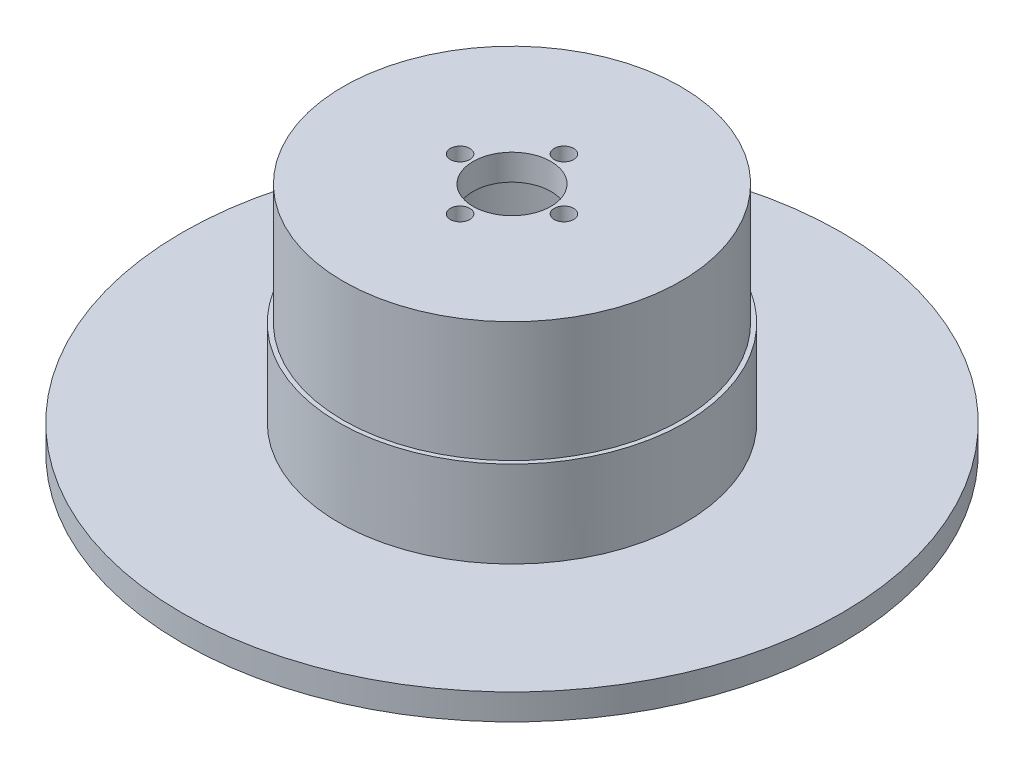
ISO-10303-21;
HEADER;
FILE_DESCRIPTION(('STEP AP214'),'2;1');
FILE_NAME('part.step','',(''),(''),'','','');
FILE_SCHEMA(('AUTOMOTIVE_DESIGN { 1 0 10303 214 1 1 1 1 }'));
ENDSEC;
DATA;
#1=APPLICATION_CONTEXT('core data for automotive mechanical design processes');
#2=APPLICATION_PROTOCOL_DEFINITION('international standard','automotive_design',2000,#1);
#3=PRODUCT_CONTEXT('',#1,'mechanical');
#4=PRODUCT('Part','Part','',(#3));
#5=PRODUCT_RELATED_PRODUCT_CATEGORY('part','',(#4));
#6=PRODUCT_DEFINITION_FORMATION('','',#4);
#7=PRODUCT_DEFINITION_CONTEXT('part definition',#1,'design');
#8=PRODUCT_DEFINITION('design','',#6,#7);
#9=PRODUCT_DEFINITION_SHAPE('','',#8);
#10=(LENGTH_UNIT() NAMED_UNIT(*) SI_UNIT(.MILLI.,.METRE.));
#11=(NAMED_UNIT(*) PLANE_ANGLE_UNIT() SI_UNIT($,.RADIAN.));
#12=(NAMED_UNIT(*) SI_UNIT($,.STERADIAN.) SOLID_ANGLE_UNIT());
#13=UNCERTAINTY_MEASURE_WITH_UNIT(LENGTH_MEASURE(1.E-05),#10,'distance_accuracy_value','');
#14=(GEOMETRIC_REPRESENTATION_CONTEXT(3) GLOBAL_UNCERTAINTY_ASSIGNED_CONTEXT((#13)) GLOBAL_UNIT_ASSIGNED_CONTEXT((#10,
#11,#12)) REPRESENTATION_CONTEXT('',''));
#15=CARTESIAN_POINT('',(0.,0.,0.));
#16=DIRECTION('',(0.,0.,1.));
#17=DIRECTION('',(1.,0.,0.));
#18=AXIS2_PLACEMENT_3D('',#15,#16,#17);
#19=CARTESIAN_POINT('',(0.,3.,0.));
#20=DIRECTION('',(0.,-1.,0.));
#21=DIRECTION('',(0.,0.,-1.));
#22=AXIS2_PLACEMENT_3D('',#19,#20,#21);
#23=PLANE('',#22);
#24=CARTESIAN_POINT('',(0.,3.,0.));
#25=DIRECTION('',(0.,-1.,0.));
#26=DIRECTION('',(0.,0.,-1.));
#27=AXIS2_PLACEMENT_3D('',#24,#25,#26);
#28=CIRCLE('',#27,38.1);
#29=CARTESIAN_POINT('',(0.,3.,-38.1));
#30=VERTEX_POINT('',#29);
#31=EDGE_CURVE('E42',#30,#30,#28,.T.);
#32=ORIENTED_EDGE('',*,*,#31,.F.);
#33=EDGE_LOOP('',(#32));
#34=FACE_BOUND('',#33,.T.);
#35=CARTESIAN_POINT('',(0.,3.,0.));
#36=DIRECTION('',(0.,-1.,0.));
#37=DIRECTION('',(0.,0.,-1.));
#38=AXIS2_PLACEMENT_3D('',#35,#36,#37);
#39=CIRCLE('',#38,20.);
#40=CARTESIAN_POINT('',(0.,3.,-20.));
#41=VERTEX_POINT('',#40);
#42=EDGE_CURVE('E10',#41,#41,#39,.F.);
#43=ORIENTED_EDGE('',*,*,#42,.F.);
#44=EDGE_LOOP('',(#43));
#45=FACE_BOUND('',#44,.T.);
#46=ADVANCED_FACE('F31',(#34,#45),#23,.F.);
#47=CARTESIAN_POINT('',(0.,23.9,0.));
#48=DIRECTION('',(0.,-1.,0.));
#49=DIRECTION('',(0.,0.,-1.));
#50=AXIS2_PLACEMENT_3D('',#47,#48,#49);
#51=CYLINDRICAL_SURFACE('',#50,19.5);
#52=CARTESIAN_POINT('',(0.,13.,0.));
#53=DIRECTION('',(0.,1.,0.));
#54=DIRECTION('',(0.,0.,1.));
#55=AXIS2_PLACEMENT_3D('',#52,#53,#54);
#56=CIRCLE('',#55,19.5);
#57=CARTESIAN_POINT('',(0.,13.,19.5));
#58=VERTEX_POINT('',#57);
#59=EDGE_CURVE('E54',#58,#58,#56,.T.);
#60=ORIENTED_EDGE('',*,*,#59,.T.);
#61=EDGE_LOOP('',(#60));
#62=FACE_BOUND('',#61,.T.);
#63=CARTESIAN_POINT('',(0.,26.9,0.));
#64=DIRECTION('',(0.,1.,0.));
#65=DIRECTION('',(0.,0.,1.));
#66=AXIS2_PLACEMENT_3D('',#63,#64,#65);
#67=CIRCLE('',#66,19.5);
#68=CARTESIAN_POINT('',(0.,26.9,19.5));
#69=VERTEX_POINT('',#68);
#70=EDGE_CURVE('E60',#69,#69,#67,.T.);
#71=ORIENTED_EDGE('',*,*,#70,.F.);
#72=EDGE_LOOP('',(#71));
#73=FACE_BOUND('',#72,.T.);
#74=ADVANCED_FACE('F33',(#62,#73),#51,.T.);
#75=CARTESIAN_POINT('',(0.,0.,0.));
#76=DIRECTION('',(0.,1.,0.));
#77=DIRECTION('',(0.,0.,1.));
#78=AXIS2_PLACEMENT_3D('',#75,#76,#77);
#79=PLANE('',#78);
#80=CARTESIAN_POINT('',(0.,0.,0.));
#81=DIRECTION('',(0.,1.,0.));
#82=DIRECTION('',(0.,0.,1.));
#83=AXIS2_PLACEMENT_3D('',#80,#81,#82);
#84=CIRCLE('',#83,14.5);
#85=CARTESIAN_POINT('',(0.,0.,14.5));
#86=VERTEX_POINT('',#85);
#87=EDGE_CURVE('E38',#86,#86,#84,.T.);
#88=ORIENTED_EDGE('',*,*,#87,.T.);
#89=EDGE_LOOP('',(#88));
#90=FACE_BOUND('',#89,.T.);
#91=CARTESIAN_POINT('',(0.,0.,0.));
#92=DIRECTION('',(0.,-1.,0.));
#93=DIRECTION('',(0.,0.,-1.));
#94=AXIS2_PLACEMENT_3D('',#91,#92,#93);
#95=CIRCLE('',#94,38.1);
#96=CARTESIAN_POINT('',(0.,0.,-38.1));
#97=VERTEX_POINT('',#96);
#98=EDGE_CURVE('E46',#97,#97,#95,.T.);
#99=ORIENTED_EDGE('',*,*,#98,.T.);
#100=EDGE_LOOP('',(#99));
#101=FACE_BOUND('',#100,.T.);
#102=ADVANCED_FACE('F121',(#90,#101),#79,.F.);
#103=CARTESIAN_POINT('',(0.,23.9,0.));
#104=DIRECTION('',(0.,-1.,0.));
#105=DIRECTION('',(0.,0.,-1.));
#106=AXIS2_PLACEMENT_3D('',#103,#104,#105);
#107=CYLINDRICAL_SURFACE('',#106,14.5);
#108=CARTESIAN_POINT('',(0.,23.9,0.));
#109=DIRECTION('',(0.,1.,0.));
#110=DIRECTION('',(0.,0.,1.));
#111=AXIS2_PLACEMENT_3D('',#108,#109,#110);
#112=CIRCLE('',#111,14.5);
#113=CARTESIAN_POINT('',(0.,23.9,14.5));
#114=VERTEX_POINT('',#113);
#115=EDGE_CURVE('E57',#114,#114,#112,.T.);
#116=ORIENTED_EDGE('',*,*,#115,.T.);
#117=EDGE_LOOP('',(#116));
#118=FACE_BOUND('',#117,.T.);
#119=ORIENTED_EDGE('',*,*,#87,.F.);
#120=EDGE_LOOP('',(#119));
#121=FACE_BOUND('',#120,.T.);
#122=ADVANCED_FACE('F132',(#118,#121),#107,.F.);
#123=CARTESIAN_POINT('',(0.,3.,0.));
#124=DIRECTION('',(0.,-1.,0.));
#125=DIRECTION('',(0.,0.,-1.));
#126=AXIS2_PLACEMENT_3D('',#123,#124,#125);
#127=CYLINDRICAL_SURFACE('',#126,38.1);
#128=ORIENTED_EDGE('',*,*,#31,.T.);
#129=EDGE_LOOP('',(#128));
#130=FACE_BOUND('',#129,.T.);
#131=ORIENTED_EDGE('',*,*,#98,.F.);
#132=EDGE_LOOP('',(#131));
#133=FACE_BOUND('',#132,.T.);
#134=ADVANCED_FACE('F128',(#130,#133),#127,.T.);
#135=CARTESIAN_POINT('',(0.,13.,0.));
#136=DIRECTION('',(0.,1.,0.));
#137=DIRECTION('',(0.,0.,1.));
#138=AXIS2_PLACEMENT_3D('',#135,#136,#137);
#139=PLANE('',#138);
#140=CARTESIAN_POINT('',(0.,13.,0.));
#141=DIRECTION('',(0.,1.,0.));
#142=DIRECTION('',(0.,0.,1.));
#143=AXIS2_PLACEMENT_3D('',#140,#141,#142);
#144=CIRCLE('',#143,20.);
#145=CARTESIAN_POINT('',(0.,13.,20.));
#146=VERTEX_POINT('',#145);
#147=EDGE_CURVE('E50',#146,#146,#144,.T.);
#148=ORIENTED_EDGE('',*,*,#147,.T.);
#149=EDGE_LOOP('',(#148));
#150=FACE_BOUND('',#149,.T.);
#151=ORIENTED_EDGE('',*,*,#59,.F.);
#152=EDGE_LOOP('',(#151));
#153=FACE_BOUND('',#152,.T.);
#154=ADVANCED_FACE('F131',(#150,#153),#139,.T.);
#155=CARTESIAN_POINT('',(0.,13.,0.));
#156=DIRECTION('',(0.,-1.,0.));
#157=DIRECTION('',(0.,0.,-1.));
#158=AXIS2_PLACEMENT_3D('',#155,#156,#157);
#159=CYLINDRICAL_SURFACE('',#158,20.);
#160=ORIENTED_EDGE('',*,*,#147,.F.);
#161=EDGE_LOOP('',(#160));
#162=FACE_BOUND('',#161,.T.);
#163=ORIENTED_EDGE('',*,*,#42,.T.);
#164=EDGE_LOOP('',(#163));
#165=FACE_BOUND('',#164,.T.);
#166=ADVANCED_FACE('F110',(#162,#165),#159,.T.);
#167=CARTESIAN_POINT('',(0.,23.9,0.));
#168=DIRECTION('',(0.,1.,0.));
#169=DIRECTION('',(0.,0.,1.));
#170=AXIS2_PLACEMENT_3D('',#167,#168,#169);
#171=PLANE('',#170);
#172=CARTESIAN_POINT('',(-6.,23.9,0.));
#173=DIRECTION('',(0.,1.,0.));
#174=DIRECTION('',(0.,0.,1.));
#175=AXIS2_PLACEMENT_3D('',#172,#173,#174);
#176=CIRCLE('',#175,1.125);
#177=CARTESIAN_POINT('',(-6.,23.9,1.12499999999994));
#178=VERTEX_POINT('',#177);
#179=EDGE_CURVE('E88',#178,#178,#176,.T.);
#180=ORIENTED_EDGE('',*,*,#179,.T.);
#181=EDGE_LOOP('',(#180));
#182=FACE_BOUND('',#181,.T.);
#183=CARTESIAN_POINT('',(0.,23.9,6.));
#184=DIRECTION('',(0.,1.,0.));
#185=DIRECTION('',(0.,0.,1.));
#186=AXIS2_PLACEMENT_3D('',#183,#184,#185);
#187=CIRCLE('',#186,1.125);
#188=CARTESIAN_POINT('',(0.,23.9,7.125));
#189=VERTEX_POINT('',#188);
#190=EDGE_CURVE('E82',#189,#189,#187,.T.);
#191=ORIENTED_EDGE('',*,*,#190,.T.);
#192=EDGE_LOOP('',(#191));
#193=FACE_BOUND('',#192,.T.);
#194=CARTESIAN_POINT('',(6.,23.9,0.));
#195=DIRECTION('',(0.,1.,0.));
#196=DIRECTION('',(0.,0.,1.));
#197=AXIS2_PLACEMENT_3D('',#194,#195,#196);
#198=CIRCLE('',#197,1.125);
#199=CARTESIAN_POINT('',(6.,23.9,1.12500000000002));
#200=VERTEX_POINT('',#199);
#201=EDGE_CURVE('E76',#200,#200,#198,.T.);
#202=ORIENTED_EDGE('',*,*,#201,.T.);
#203=EDGE_LOOP('',(#202));
#204=FACE_BOUND('',#203,.T.);
#205=CARTESIAN_POINT('',(0.,23.9,-6.));
#206=DIRECTION('',(0.,1.,0.));
#207=DIRECTION('',(0.,0.,1.));
#208=AXIS2_PLACEMENT_3D('',#205,#206,#207);
#209=CIRCLE('',#208,1.125);
#210=CARTESIAN_POINT('',(0.,23.9,-4.875));
#211=VERTEX_POINT('',#210);
#212=EDGE_CURVE('E70',#211,#211,#209,.T.);
#213=ORIENTED_EDGE('',*,*,#212,.T.);
#214=EDGE_LOOP('',(#213));
#215=FACE_BOUND('',#214,.T.);
#216=CARTESIAN_POINT('',(0.,23.9,0.));
#217=DIRECTION('',(0.,1.,0.));
#218=DIRECTION('',(0.,0.,1.));
#219=AXIS2_PLACEMENT_3D('',#216,#217,#218);
#220=CIRCLE('',#219,4.5);
#221=CARTESIAN_POINT('',(0.,23.9,4.5));
#222=VERTEX_POINT('',#221);
#223=EDGE_CURVE('E64',#222,#222,#220,.T.);
#224=ORIENTED_EDGE('',*,*,#223,.T.);
#225=EDGE_LOOP('',(#224));
#226=FACE_BOUND('',#225,.T.);
#227=ORIENTED_EDGE('',*,*,#115,.F.);
#228=EDGE_LOOP('',(#227));
#229=FACE_BOUND('',#228,.T.);
#230=ADVANCED_FACE('F100',(#182,#193,#204,#215,#226,#229),#171,.F.);
#231=CARTESIAN_POINT('',(0.,26.9,0.));
#232=DIRECTION('',(0.,1.,0.));
#233=DIRECTION('',(0.,0.,1.));
#234=AXIS2_PLACEMENT_3D('',#231,#232,#233);
#235=PLANE('',#234);
#236=CARTESIAN_POINT('',(0.,26.9,6.));
#237=DIRECTION('',(0.,1.,0.));
#238=DIRECTION('',(0.,0.,1.));
#239=AXIS2_PLACEMENT_3D('',#236,#237,#238);
#240=CIRCLE('',#239,1.125);
#241=CARTESIAN_POINT('',(0.,26.9,7.125));
#242=VERTEX_POINT('',#241);
#243=EDGE_CURVE('E79',#242,#242,#240,.T.);
#244=ORIENTED_EDGE('',*,*,#243,.F.);
#245=EDGE_LOOP('',(#244));
#246=FACE_BOUND('',#245,.T.);
#247=CARTESIAN_POINT('',(0.,26.9,-6.));
#248=DIRECTION('',(0.,1.,0.));
#249=DIRECTION('',(0.,0.,1.));
#250=AXIS2_PLACEMENT_3D('',#247,#248,#249);
#251=CIRCLE('',#250,1.125);
#252=CARTESIAN_POINT('',(0.,26.9,-4.875));
#253=VERTEX_POINT('',#252);
#254=EDGE_CURVE('E67',#253,#253,#251,.T.);
#255=ORIENTED_EDGE('',*,*,#254,.F.);
#256=EDGE_LOOP('',(#255));
#257=FACE_BOUND('',#256,.T.);
#258=ORIENTED_EDGE('',*,*,#70,.T.);
#259=EDGE_LOOP('',(#258));
#260=FACE_BOUND('',#259,.T.);
#261=CARTESIAN_POINT('',(0.,26.9,0.));
#262=DIRECTION('',(0.,1.,0.));
#263=DIRECTION('',(0.,0.,1.));
#264=AXIS2_PLACEMENT_3D('',#261,#262,#263);
#265=CIRCLE('',#264,4.5);
#266=CARTESIAN_POINT('',(0.,26.9,4.5));
#267=VERTEX_POINT('',#266);
#268=EDGE_CURVE('E63',#267,#267,#265,.T.);
#269=ORIENTED_EDGE('',*,*,#268,.F.);
#270=EDGE_LOOP('',(#269));
#271=FACE_BOUND('',#270,.T.);
#272=CARTESIAN_POINT('',(6.,26.9,0.));
#273=DIRECTION('',(0.,1.,0.));
#274=DIRECTION('',(0.,0.,1.));
#275=AXIS2_PLACEMENT_3D('',#272,#273,#274);
#276=CIRCLE('',#275,1.125);
#277=CARTESIAN_POINT('',(6.,26.9,1.12500000000002));
#278=VERTEX_POINT('',#277);
#279=EDGE_CURVE('E73',#278,#278,#276,.T.);
#280=ORIENTED_EDGE('',*,*,#279,.F.);
#281=EDGE_LOOP('',(#280));
#282=FACE_BOUND('',#281,.T.);
#283=CARTESIAN_POINT('',(-6.,26.9,0.));
#284=DIRECTION('',(0.,1.,0.));
#285=DIRECTION('',(0.,0.,1.));
#286=AXIS2_PLACEMENT_3D('',#283,#284,#285);
#287=CIRCLE('',#286,1.125);
#288=CARTESIAN_POINT('',(-6.,26.9,1.12499999999994));
#289=VERTEX_POINT('',#288);
#290=EDGE_CURVE('E85',#289,#289,#287,.T.);
#291=ORIENTED_EDGE('',*,*,#290,.F.);
#292=EDGE_LOOP('',(#291));
#293=FACE_BOUND('',#292,.T.);
#294=ADVANCED_FACE('F97',(#246,#257,#260,#271,#282,#293),#235,.T.);
#295=CARTESIAN_POINT('',(0.,26.9,0.));
#296=DIRECTION('',(0.,-1.,0.));
#297=DIRECTION('',(0.,0.,-1.));
#298=AXIS2_PLACEMENT_3D('',#295,#296,#297);
#299=CYLINDRICAL_SURFACE('',#298,4.5);
#300=ORIENTED_EDGE('',*,*,#268,.T.);
#301=EDGE_LOOP('',(#300));
#302=FACE_BOUND('',#301,.T.);
#303=ORIENTED_EDGE('',*,*,#223,.F.);
#304=EDGE_LOOP('',(#303));
#305=FACE_BOUND('',#304,.T.);
#306=ADVANCED_FACE('F99',(#302,#305),#299,.F.);
#307=CARTESIAN_POINT('',(0.,26.9,-6.));
#308=DIRECTION('',(0.,-1.,0.));
#309=DIRECTION('',(0.,0.,-1.));
#310=AXIS2_PLACEMENT_3D('',#307,#308,#309);
#311=CYLINDRICAL_SURFACE('',#310,1.125);
#312=ORIENTED_EDGE('',*,*,#254,.T.);
#313=EDGE_LOOP('',(#312));
#314=FACE_BOUND('',#313,.T.);
#315=ORIENTED_EDGE('',*,*,#212,.F.);
#316=EDGE_LOOP('',(#315));
#317=FACE_BOUND('',#316,.T.);
#318=ADVANCED_FACE('F107',(#314,#317),#311,.F.);
#319=CARTESIAN_POINT('',(6.,26.9,0.));
#320=DIRECTION('',(0.,-1.,0.));
#321=DIRECTION('',(0.,0.,-1.));
#322=AXIS2_PLACEMENT_3D('',#319,#320,#321);
#323=CYLINDRICAL_SURFACE('',#322,1.125);
#324=ORIENTED_EDGE('',*,*,#279,.T.);
#325=EDGE_LOOP('',(#324));
#326=FACE_BOUND('',#325,.T.);
#327=ORIENTED_EDGE('',*,*,#201,.F.);
#328=EDGE_LOOP('',(#327));
#329=FACE_BOUND('',#328,.T.);
#330=ADVANCED_FACE('F189',(#326,#329),#323,.F.);
#331=CARTESIAN_POINT('',(0.,26.9,6.));
#332=DIRECTION('',(0.,-1.,0.));
#333=DIRECTION('',(0.,0.,-1.));
#334=AXIS2_PLACEMENT_3D('',#331,#332,#333);
#335=CYLINDRICAL_SURFACE('',#334,1.125);
#336=ORIENTED_EDGE('',*,*,#243,.T.);
#337=EDGE_LOOP('',(#336));
#338=FACE_BOUND('',#337,.T.);
#339=ORIENTED_EDGE('',*,*,#190,.F.);
#340=EDGE_LOOP('',(#339));
#341=FACE_BOUND('',#340,.T.);
#342=ADVANCED_FACE('F199',(#338,#341),#335,.F.);
#343=CARTESIAN_POINT('',(-6.,26.9,0.));
#344=DIRECTION('',(0.,-1.,0.));
#345=DIRECTION('',(0.,0.,-1.));
#346=AXIS2_PLACEMENT_3D('',#343,#344,#345);
#347=CYLINDRICAL_SURFACE('',#346,1.125);
#348=ORIENTED_EDGE('',*,*,#290,.T.);
#349=EDGE_LOOP('',(#348));
#350=FACE_BOUND('',#349,.T.);
#351=ORIENTED_EDGE('',*,*,#179,.F.);
#352=EDGE_LOOP('',(#351));
#353=FACE_BOUND('',#352,.T.);
#354=ADVANCED_FACE('F94',(#350,#353),#347,.F.);
#355=CLOSED_SHELL('',(#46,#74,#102,#122,#134,#154,#166,#230,#294,#306,#318,#330,#342,#354));
#356=MANIFOLD_SOLID_BREP('B2',#355);
#357=ADVANCED_BREP_SHAPE_REPRESENTATION('',(#18,#356),#14);
#358=SHAPE_DEFINITION_REPRESENTATION(#9,#357);
ENDSEC;
END-ISO-10303-21;
